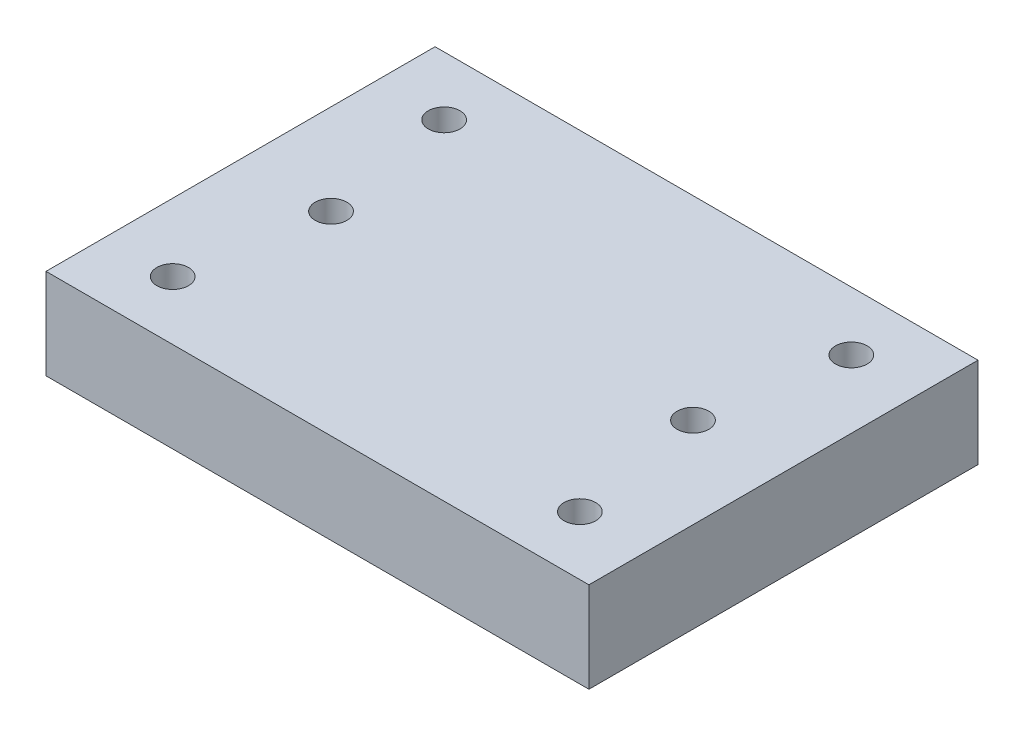
ISO-10303-21;
HEADER;
FILE_DESCRIPTION(('STEP AP214'),'2;1');
FILE_NAME('part.step','',(''),(''),'','','');
FILE_SCHEMA(('AUTOMOTIVE_DESIGN { 1 0 10303 214 1 1 1 1 }'));
ENDSEC;
DATA;
#1=APPLICATION_CONTEXT('core data for automotive mechanical design processes');
#2=APPLICATION_PROTOCOL_DEFINITION('international standard','automotive_design',2000,#1);
#3=PRODUCT_CONTEXT('',#1,'mechanical');
#4=PRODUCT('Part','Part','',(#3));
#5=PRODUCT_RELATED_PRODUCT_CATEGORY('part','',(#4));
#6=PRODUCT_DEFINITION_FORMATION('','',#4);
#7=PRODUCT_DEFINITION_CONTEXT('part definition',#1,'design');
#8=PRODUCT_DEFINITION('design','',#6,#7);
#9=PRODUCT_DEFINITION_SHAPE('','',#8);
#10=(LENGTH_UNIT() NAMED_UNIT(*) SI_UNIT(.MILLI.,.METRE.));
#11=(NAMED_UNIT(*) PLANE_ANGLE_UNIT() SI_UNIT($,.RADIAN.));
#12=(NAMED_UNIT(*) SI_UNIT($,.STERADIAN.) SOLID_ANGLE_UNIT());
#13=UNCERTAINTY_MEASURE_WITH_UNIT(LENGTH_MEASURE(1.E-05),#10,'distance_accuracy_value','');
#14=(GEOMETRIC_REPRESENTATION_CONTEXT(3) GLOBAL_UNCERTAINTY_ASSIGNED_CONTEXT((#13)) GLOBAL_UNIT_ASSIGNED_CONTEXT((#10,
#11,#12)) REPRESENTATION_CONTEXT('',''));
#15=CARTESIAN_POINT('',(0.,0.,0.));
#16=DIRECTION('',(0.,0.,1.));
#17=DIRECTION('',(1.,0.,0.));
#18=AXIS2_PLACEMENT_3D('',#15,#16,#17);
#19=CARTESIAN_POINT('',(30.,10.,21.5));
#20=DIRECTION('',(-1.,0.,0.));
#21=DIRECTION('',(0.,0.,1.));
#22=AXIS2_PLACEMENT_3D('',#19,#20,#21);
#23=PLANE('',#22);
#24=DIRECTION('',(0.,0.,-1.));
#25=VECTOR('',#24,1.);
#26=CARTESIAN_POINT('',(30.,0.,21.5));
#27=LINE('',#26,#25);
#28=CARTESIAN_POINT('',(30.,0.,21.5));
#29=VERTEX_POINT('',#28);
#30=CARTESIAN_POINT('',(30.,0.,-21.5));
#31=VERTEX_POINT('',#30);
#32=EDGE_CURVE('E98',#29,#31,#27,.T.);
#33=ORIENTED_EDGE('',*,*,#32,.T.);
#34=DIRECTION('',(0.,-1.,0.));
#35=VECTOR('',#34,1.);
#36=CARTESIAN_POINT('',(30.,10.,-21.5));
#37=LINE('',#36,#35);
#38=CARTESIAN_POINT('',(30.,10.,-21.5));
#39=VERTEX_POINT('',#38);
#40=EDGE_CURVE('E11',#39,#31,#37,.T.);
#41=ORIENTED_EDGE('',*,*,#40,.F.);
#42=DIRECTION('',(0.,0.,-1.));
#43=VECTOR('',#42,1.);
#44=CARTESIAN_POINT('',(30.,10.,21.5));
#45=LINE('',#44,#43);
#46=CARTESIAN_POINT('',(30.,10.,21.5));
#47=VERTEX_POINT('',#46);
#48=EDGE_CURVE('E86',#47,#39,#45,.T.);
#49=ORIENTED_EDGE('',*,*,#48,.F.);
#50=DIRECTION('',(0.,-1.,0.));
#51=VECTOR('',#50,1.);
#52=CARTESIAN_POINT('',(30.,10.,21.5));
#53=LINE('',#52,#51);
#54=EDGE_CURVE('E94',#47,#29,#53,.T.);
#55=ORIENTED_EDGE('',*,*,#54,.T.);
#56=EDGE_LOOP('',(#33,#41,#49,#55));
#57=FACE_BOUND('',#56,.T.);
#58=ADVANCED_FACE('F35',(#57),#23,.F.);
#59=CARTESIAN_POINT('',(-30.,10.,-21.5));
#60=DIRECTION('',(0.,0.,1.));
#61=DIRECTION('',(1.,0.,0.));
#62=AXIS2_PLACEMENT_3D('',#59,#60,#61);
#63=PLANE('',#62);
#64=DIRECTION('',(-1.,0.,0.));
#65=VECTOR('',#64,1.);
#66=CARTESIAN_POINT('',(-30.,0.,-21.5));
#67=LINE('',#66,#65);
#68=CARTESIAN_POINT('',(-30.,0.,-21.5));
#69=VERTEX_POINT('',#68);
#70=EDGE_CURVE('E90',#31,#69,#67,.T.);
#71=ORIENTED_EDGE('',*,*,#70,.T.);
#72=DIRECTION('',(0.,-1.,0.));
#73=VECTOR('',#72,1.);
#74=CARTESIAN_POINT('',(-30.,10.,-21.5));
#75=LINE('',#74,#73);
#76=CARTESIAN_POINT('',(-30.,10.,-21.5));
#77=VERTEX_POINT('',#76);
#78=EDGE_CURVE('E43',#77,#69,#75,.T.);
#79=ORIENTED_EDGE('',*,*,#78,.F.);
#80=DIRECTION('',(-1.,0.,0.));
#81=VECTOR('',#80,1.);
#82=CARTESIAN_POINT('',(-30.,10.,-21.5));
#83=LINE('',#82,#81);
#84=EDGE_CURVE('E81',#39,#77,#83,.T.);
#85=ORIENTED_EDGE('',*,*,#84,.F.);
#86=ORIENTED_EDGE('',*,*,#40,.T.);
#87=EDGE_LOOP('',(#71,#79,#85,#86));
#88=FACE_BOUND('',#87,.T.);
#89=ADVANCED_FACE('F89',(#88),#63,.F.);
#90=CARTESIAN_POINT('',(-30.,10.,21.5));
#91=DIRECTION('',(1.,0.,0.));
#92=DIRECTION('',(0.,0.,-1.));
#93=AXIS2_PLACEMENT_3D('',#90,#91,#92);
#94=PLANE('',#93);
#95=DIRECTION('',(0.,0.,1.));
#96=VECTOR('',#95,1.);
#97=CARTESIAN_POINT('',(-30.,0.,21.5));
#98=LINE('',#97,#96);
#99=CARTESIAN_POINT('',(-30.,0.,21.5));
#100=VERTEX_POINT('',#99);
#101=EDGE_CURVE('E68',#69,#100,#98,.T.);
#102=ORIENTED_EDGE('',*,*,#101,.T.);
#103=DIRECTION('',(0.,-1.,0.));
#104=VECTOR('',#103,1.);
#105=CARTESIAN_POINT('',(-30.,10.,21.5));
#106=LINE('',#105,#104);
#107=CARTESIAN_POINT('',(-30.,10.,21.5));
#108=VERTEX_POINT('',#107);
#109=EDGE_CURVE('E91',#108,#100,#106,.T.);
#110=ORIENTED_EDGE('',*,*,#109,.F.);
#111=DIRECTION('',(0.,0.,1.));
#112=VECTOR('',#111,1.);
#113=CARTESIAN_POINT('',(-30.,10.,21.5));
#114=LINE('',#113,#112);
#115=EDGE_CURVE('E84',#77,#108,#114,.T.);
#116=ORIENTED_EDGE('',*,*,#115,.F.);
#117=ORIENTED_EDGE('',*,*,#78,.T.);
#118=EDGE_LOOP('',(#102,#110,#116,#117));
#119=FACE_BOUND('',#118,.T.);
#120=ADVANCED_FACE('F92',(#119),#94,.F.);
#121=CARTESIAN_POINT('',(-30.,10.,21.5));
#122=DIRECTION('',(0.,0.,-1.));
#123=DIRECTION('',(-1.,0.,0.));
#124=AXIS2_PLACEMENT_3D('',#121,#122,#123);
#125=PLANE('',#124);
#126=DIRECTION('',(1.,0.,0.));
#127=VECTOR('',#126,1.);
#128=CARTESIAN_POINT('',(-30.,0.,21.5));
#129=LINE('',#128,#127);
#130=EDGE_CURVE('E74',#100,#29,#129,.T.);
#131=ORIENTED_EDGE('',*,*,#130,.T.);
#132=ORIENTED_EDGE('',*,*,#54,.F.);
#133=DIRECTION('',(1.,0.,0.));
#134=VECTOR('',#133,1.);
#135=CARTESIAN_POINT('',(-30.,10.,21.5));
#136=LINE('',#135,#134);
#137=EDGE_CURVE('E51',#108,#47,#136,.T.);
#138=ORIENTED_EDGE('',*,*,#137,.F.);
#139=ORIENTED_EDGE('',*,*,#109,.T.);
#140=EDGE_LOOP('',(#131,#132,#138,#139));
#141=FACE_BOUND('',#140,.T.);
#142=ADVANCED_FACE('F106',(#141),#125,.F.);
#143=CARTESIAN_POINT('',(0.,10.,0.));
#144=DIRECTION('',(0.,-1.,0.));
#145=DIRECTION('',(0.,0.,-1.));
#146=AXIS2_PLACEMENT_3D('',#143,#144,#145);
#147=PLANE('',#146);
#148=CARTESIAN_POINT('',(20.,10.,0.));
#149=DIRECTION('',(0.,1.,0.));
#150=DIRECTION('',(0.,0.,1.));
#151=AXIS2_PLACEMENT_3D('',#148,#149,#150);
#152=CIRCLE('',#151,1.75);
#153=CARTESIAN_POINT('',(20.,10.,1.75));
#154=VERTEX_POINT('',#153);
#155=EDGE_CURVE('E142',#154,#154,#152,.T.);
#156=ORIENTED_EDGE('',*,*,#155,.F.);
#157=EDGE_LOOP('',(#156));
#158=FACE_BOUND('',#157,.T.);
#159=CARTESIAN_POINT('',(-20.,10.,0.));
#160=DIRECTION('',(0.,1.,0.));
#161=DIRECTION('',(0.,0.,1.));
#162=AXIS2_PLACEMENT_3D('',#159,#160,#161);
#163=CIRCLE('',#162,1.75);
#164=CARTESIAN_POINT('',(-20.,10.,1.75));
#165=VERTEX_POINT('',#164);
#166=EDGE_CURVE('E136',#165,#165,#163,.T.);
#167=ORIENTED_EDGE('',*,*,#166,.F.);
#168=EDGE_LOOP('',(#167));
#169=FACE_BOUND('',#168,.T.);
#170=CARTESIAN_POINT('',(-22.5,10.,15.));
#171=DIRECTION('',(0.,1.,0.));
#172=DIRECTION('',(0.,0.,-1.));
#173=AXIS2_PLACEMENT_3D('',#170,#171,#172);
#174=CIRCLE('',#173,1.75);
#175=CARTESIAN_POINT('',(-22.5,10.,13.25));
#176=VERTEX_POINT('',#175);
#177=EDGE_CURVE('E130',#176,#176,#174,.T.);
#178=ORIENTED_EDGE('',*,*,#177,.F.);
#179=EDGE_LOOP('',(#178));
#180=FACE_BOUND('',#179,.T.);
#181=CARTESIAN_POINT('',(22.5,10.,15.));
#182=DIRECTION('',(0.,1.,0.));
#183=DIRECTION('',(0.,0.,1.));
#184=AXIS2_PLACEMENT_3D('',#181,#182,#183);
#185=CIRCLE('',#184,1.75);
#186=CARTESIAN_POINT('',(22.5,10.,16.75));
#187=VERTEX_POINT('',#186);
#188=EDGE_CURVE('E124',#187,#187,#185,.T.);
#189=ORIENTED_EDGE('',*,*,#188,.F.);
#190=EDGE_LOOP('',(#189));
#191=FACE_BOUND('',#190,.T.);
#192=CARTESIAN_POINT('',(22.5,10.,-15.));
#193=DIRECTION('',(0.,1.,0.));
#194=DIRECTION('',(0.,0.,-1.));
#195=AXIS2_PLACEMENT_3D('',#192,#193,#194);
#196=CIRCLE('',#195,1.75);
#197=CARTESIAN_POINT('',(22.5,10.,-16.75));
#198=VERTEX_POINT('',#197);
#199=EDGE_CURVE('E118',#198,#198,#196,.T.);
#200=ORIENTED_EDGE('',*,*,#199,.F.);
#201=EDGE_LOOP('',(#200));
#202=FACE_BOUND('',#201,.T.);
#203=CARTESIAN_POINT('',(-22.5,10.,-15.));
#204=DIRECTION('',(0.,1.,0.));
#205=DIRECTION('',(0.,0.,1.));
#206=AXIS2_PLACEMENT_3D('',#203,#204,#205);
#207=CIRCLE('',#206,1.75);
#208=CARTESIAN_POINT('',(-22.5,10.,-13.25));
#209=VERTEX_POINT('',#208);
#210=EDGE_CURVE('E112',#209,#209,#207,.T.);
#211=ORIENTED_EDGE('',*,*,#210,.F.);
#212=EDGE_LOOP('',(#211));
#213=FACE_BOUND('',#212,.T.);
#214=ORIENTED_EDGE('',*,*,#48,.T.);
#215=ORIENTED_EDGE('',*,*,#84,.T.);
#216=ORIENTED_EDGE('',*,*,#115,.T.);
#217=ORIENTED_EDGE('',*,*,#137,.T.);
#218=EDGE_LOOP('',(#214,#215,#216,#217));
#219=FACE_BOUND('',#218,.T.);
#220=ADVANCED_FACE('F82',(#158,#169,#180,#191,#202,#213,#219),#147,.F.);
#221=CARTESIAN_POINT('',(0.,0.,0.));
#222=DIRECTION('',(0.,-1.,0.));
#223=DIRECTION('',(0.,0.,-1.));
#224=AXIS2_PLACEMENT_3D('',#221,#222,#223);
#225=PLANE('',#224);
#226=CARTESIAN_POINT('',(20.,0.,0.));
#227=DIRECTION('',(0.,1.,0.));
#228=DIRECTION('',(0.,0.,1.));
#229=AXIS2_PLACEMENT_3D('',#226,#227,#228);
#230=CIRCLE('',#229,1.75);
#231=CARTESIAN_POINT('',(20.,0.,1.75));
#232=VERTEX_POINT('',#231);
#233=EDGE_CURVE('E139',#232,#232,#230,.T.);
#234=ORIENTED_EDGE('',*,*,#233,.T.);
#235=EDGE_LOOP('',(#234));
#236=FACE_BOUND('',#235,.T.);
#237=CARTESIAN_POINT('',(-20.,0.,0.));
#238=DIRECTION('',(0.,1.,0.));
#239=DIRECTION('',(0.,0.,1.));
#240=AXIS2_PLACEMENT_3D('',#237,#238,#239);
#241=CIRCLE('',#240,1.75);
#242=CARTESIAN_POINT('',(-20.,0.,1.75));
#243=VERTEX_POINT('',#242);
#244=EDGE_CURVE('E133',#243,#243,#241,.T.);
#245=ORIENTED_EDGE('',*,*,#244,.T.);
#246=EDGE_LOOP('',(#245));
#247=FACE_BOUND('',#246,.T.);
#248=CARTESIAN_POINT('',(-22.5,0.,15.));
#249=DIRECTION('',(0.,1.,0.));
#250=DIRECTION('',(0.,0.,-1.));
#251=AXIS2_PLACEMENT_3D('',#248,#249,#250);
#252=CIRCLE('',#251,1.75);
#253=CARTESIAN_POINT('',(-22.5,0.,13.25));
#254=VERTEX_POINT('',#253);
#255=EDGE_CURVE('E127',#254,#254,#252,.T.);
#256=ORIENTED_EDGE('',*,*,#255,.T.);
#257=EDGE_LOOP('',(#256));
#258=FACE_BOUND('',#257,.T.);
#259=CARTESIAN_POINT('',(22.5,0.,15.));
#260=DIRECTION('',(0.,1.,0.));
#261=DIRECTION('',(0.,0.,1.));
#262=AXIS2_PLACEMENT_3D('',#259,#260,#261);
#263=CIRCLE('',#262,1.75);
#264=CARTESIAN_POINT('',(22.5,0.,16.75));
#265=VERTEX_POINT('',#264);
#266=EDGE_CURVE('E121',#265,#265,#263,.T.);
#267=ORIENTED_EDGE('',*,*,#266,.T.);
#268=EDGE_LOOP('',(#267));
#269=FACE_BOUND('',#268,.T.);
#270=CARTESIAN_POINT('',(22.5,0.,-15.));
#271=DIRECTION('',(0.,1.,0.));
#272=DIRECTION('',(0.,0.,-1.));
#273=AXIS2_PLACEMENT_3D('',#270,#271,#272);
#274=CIRCLE('',#273,1.75);
#275=CARTESIAN_POINT('',(22.5,0.,-16.75));
#276=VERTEX_POINT('',#275);
#277=EDGE_CURVE('E115',#276,#276,#274,.T.);
#278=ORIENTED_EDGE('',*,*,#277,.T.);
#279=EDGE_LOOP('',(#278));
#280=FACE_BOUND('',#279,.T.);
#281=CARTESIAN_POINT('',(-22.5,0.,-15.));
#282=DIRECTION('',(0.,1.,0.));
#283=DIRECTION('',(0.,0.,1.));
#284=AXIS2_PLACEMENT_3D('',#281,#282,#283);
#285=CIRCLE('',#284,1.75);
#286=CARTESIAN_POINT('',(-22.5,0.,-13.25));
#287=VERTEX_POINT('',#286);
#288=EDGE_CURVE('E101',#287,#287,#285,.T.);
#289=ORIENTED_EDGE('',*,*,#288,.T.);
#290=EDGE_LOOP('',(#289));
#291=FACE_BOUND('',#290,.T.);
#292=ORIENTED_EDGE('',*,*,#32,.F.);
#293=ORIENTED_EDGE('',*,*,#130,.F.);
#294=ORIENTED_EDGE('',*,*,#101,.F.);
#295=ORIENTED_EDGE('',*,*,#70,.F.);
#296=EDGE_LOOP('',(#292,#293,#294,#295));
#297=FACE_BOUND('',#296,.T.);
#298=ADVANCED_FACE('F109',(#236,#247,#258,#269,#280,#291,#297),#225,.T.);
#299=CARTESIAN_POINT('',(-22.5,0.,-15.));
#300=DIRECTION('',(0.,1.,0.));
#301=DIRECTION('',(0.,0.,1.));
#302=AXIS2_PLACEMENT_3D('',#299,#300,#301);
#303=CYLINDRICAL_SURFACE('',#302,1.75);
#304=ORIENTED_EDGE('',*,*,#288,.F.);
#305=EDGE_LOOP('',(#304));
#306=FACE_BOUND('',#305,.T.);
#307=ORIENTED_EDGE('',*,*,#210,.T.);
#308=EDGE_LOOP('',(#307));
#309=FACE_BOUND('',#308,.T.);
#310=ADVANCED_FACE('F170',(#306,#309),#303,.F.);
#311=CARTESIAN_POINT('',(22.5,0.,-15.));
#312=DIRECTION('',(0.,1.,0.));
#313=DIRECTION('',(0.,0.,1.));
#314=AXIS2_PLACEMENT_3D('',#311,#312,#313);
#315=CYLINDRICAL_SURFACE('',#314,1.75);
#316=ORIENTED_EDGE('',*,*,#277,.F.);
#317=EDGE_LOOP('',(#316));
#318=FACE_BOUND('',#317,.T.);
#319=ORIENTED_EDGE('',*,*,#199,.T.);
#320=EDGE_LOOP('',(#319));
#321=FACE_BOUND('',#320,.T.);
#322=ADVANCED_FACE('F172',(#318,#321),#315,.F.);
#323=CARTESIAN_POINT('',(22.5,0.,15.));
#324=DIRECTION('',(0.,1.,0.));
#325=DIRECTION('',(0.,0.,1.));
#326=AXIS2_PLACEMENT_3D('',#323,#324,#325);
#327=CYLINDRICAL_SURFACE('',#326,1.75);
#328=ORIENTED_EDGE('',*,*,#266,.F.);
#329=EDGE_LOOP('',(#328));
#330=FACE_BOUND('',#329,.T.);
#331=ORIENTED_EDGE('',*,*,#188,.T.);
#332=EDGE_LOOP('',(#331));
#333=FACE_BOUND('',#332,.T.);
#334=ADVANCED_FACE('F179',(#330,#333),#327,.F.);
#335=CARTESIAN_POINT('',(-22.5,0.,15.));
#336=DIRECTION('',(0.,1.,0.));
#337=DIRECTION('',(0.,0.,1.));
#338=AXIS2_PLACEMENT_3D('',#335,#336,#337);
#339=CYLINDRICAL_SURFACE('',#338,1.75);
#340=ORIENTED_EDGE('',*,*,#255,.F.);
#341=EDGE_LOOP('',(#340));
#342=FACE_BOUND('',#341,.T.);
#343=ORIENTED_EDGE('',*,*,#177,.T.);
#344=EDGE_LOOP('',(#343));
#345=FACE_BOUND('',#344,.T.);
#346=ADVANCED_FACE('F217',(#342,#345),#339,.F.);
#347=CARTESIAN_POINT('',(-20.,0.,0.));
#348=DIRECTION('',(0.,1.,0.));
#349=DIRECTION('',(0.,0.,1.));
#350=AXIS2_PLACEMENT_3D('',#347,#348,#349);
#351=CYLINDRICAL_SURFACE('',#350,1.75);
#352=ORIENTED_EDGE('',*,*,#244,.F.);
#353=EDGE_LOOP('',(#352));
#354=FACE_BOUND('',#353,.T.);
#355=ORIENTED_EDGE('',*,*,#166,.T.);
#356=EDGE_LOOP('',(#355));
#357=FACE_BOUND('',#356,.T.);
#358=ADVANCED_FACE('F153',(#354,#357),#351,.F.);
#359=CARTESIAN_POINT('',(20.,0.,0.));
#360=DIRECTION('',(0.,1.,0.));
#361=DIRECTION('',(0.,0.,1.));
#362=AXIS2_PLACEMENT_3D('',#359,#360,#361);
#363=CYLINDRICAL_SURFACE('',#362,1.75);
#364=ORIENTED_EDGE('',*,*,#233,.F.);
#365=EDGE_LOOP('',(#364));
#366=FACE_BOUND('',#365,.T.);
#367=ORIENTED_EDGE('',*,*,#155,.T.);
#368=EDGE_LOOP('',(#367));
#369=FACE_BOUND('',#368,.T.);
#370=ADVANCED_FACE('F150',(#366,#369),#363,.F.);
#371=CLOSED_SHELL('',(#58,#89,#120,#142,#220,#298,#310,#322,#334,#346,#358,#370));
#372=MANIFOLD_SOLID_BREP('B2',#371);
#373=ADVANCED_BREP_SHAPE_REPRESENTATION('',(#18,#372),#14);
#374=SHAPE_DEFINITION_REPRESENTATION(#9,#373);
ENDSEC;
END-ISO-10303-21;
